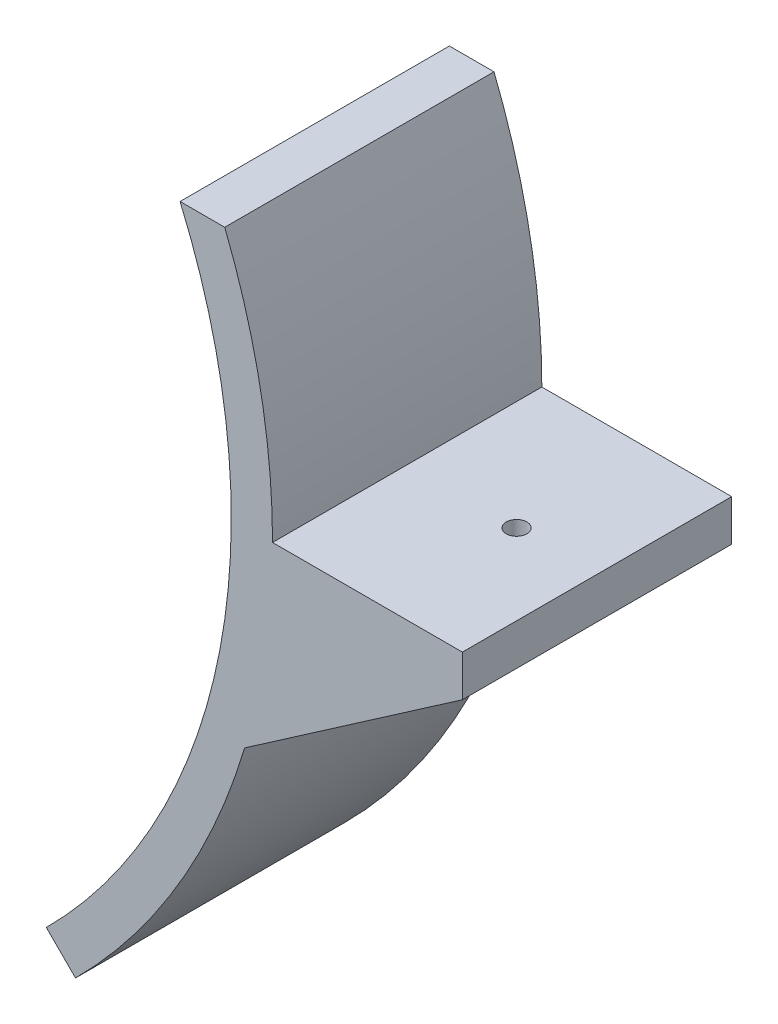
ISO-10303-21;
HEADER;
FILE_DESCRIPTION(('STEP AP214'),'2;1');
FILE_NAME('part.step','',(''),(''),'','','');
FILE_SCHEMA(('AUTOMOTIVE_DESIGN { 1 0 10303 214 1 1 1 1 }'));
ENDSEC;
DATA;
#1=APPLICATION_CONTEXT('core data for automotive mechanical design processes');
#2=APPLICATION_PROTOCOL_DEFINITION('international standard','automotive_design',2000,#1);
#3=PRODUCT_CONTEXT('',#1,'mechanical');
#4=PRODUCT('Part','Part','',(#3));
#5=PRODUCT_RELATED_PRODUCT_CATEGORY('part','',(#4));
#6=PRODUCT_DEFINITION_FORMATION('','',#4);
#7=PRODUCT_DEFINITION_CONTEXT('part definition',#1,'design');
#8=PRODUCT_DEFINITION('design','',#6,#7);
#9=PRODUCT_DEFINITION_SHAPE('','',#8);
#10=(LENGTH_UNIT() NAMED_UNIT(*) SI_UNIT(.MILLI.,.METRE.));
#11=(NAMED_UNIT(*) PLANE_ANGLE_UNIT() SI_UNIT($,.RADIAN.));
#12=(NAMED_UNIT(*) SI_UNIT($,.STERADIAN.) SOLID_ANGLE_UNIT());
#13=UNCERTAINTY_MEASURE_WITH_UNIT(LENGTH_MEASURE(1.E-05),#10,'distance_accuracy_value','');
#14=(GEOMETRIC_REPRESENTATION_CONTEXT(3) GLOBAL_UNCERTAINTY_ASSIGNED_CONTEXT((#13)) GLOBAL_UNIT_ASSIGNED_CONTEXT((#10,
#11,#12)) REPRESENTATION_CONTEXT('',''));
#15=CARTESIAN_POINT('',(0.,0.,0.));
#16=DIRECTION('',(0.,0.,1.));
#17=DIRECTION('',(1.,0.,0.));
#18=AXIS2_PLACEMENT_3D('',#15,#16,#17);
#19=CARTESIAN_POINT('',(0.,0.,65.25));
#20=DIRECTION('',(0.,1.,0.));
#21=DIRECTION('',(0.,0.,1.));
#22=AXIS2_PLACEMENT_3D('',#19,#20,#21);
#23=PLANE('',#22);
#24=CARTESIAN_POINT('',(189.5,0.,32.625));
#25=DIRECTION('',(0.,1.,0.));
#26=DIRECTION('',(0.,0.,1.));
#27=AXIS2_PLACEMENT_3D('',#24,#25,#26);
#28=CIRCLE('',#27,2.5);
#29=CARTESIAN_POINT('',(189.5,0.,35.125));
#30=VERTEX_POINT('',#29);
#31=EDGE_CURVE('E193',#30,#30,#28,.T.);
#32=ORIENTED_EDGE('',*,*,#31,.F.);
#33=EDGE_LOOP('',(#32));
#34=FACE_BOUND('',#33,.T.);
#35=DIRECTION('',(1.,0.,0.));
#36=VECTOR('',#35,1.);
#37=CARTESIAN_POINT('',(0.,0.,0.));
#38=LINE('',#37,#36);
#39=CARTESIAN_POINT('',(163.,0.,0.));
#40=VERTEX_POINT('',#39);
#41=CARTESIAN_POINT('',(209.,0.,0.));
#42=VERTEX_POINT('',#41);
#43=EDGE_CURVE('E146',#40,#42,#38,.T.);
#44=ORIENTED_EDGE('',*,*,#43,.F.);
#45=DIRECTION('',(0.,0.,-1.));
#46=VECTOR('',#45,1.);
#47=CARTESIAN_POINT('',(163.,0.,65.25));
#48=LINE('',#47,#46);
#49=CARTESIAN_POINT('',(163.,0.,65.25));
#50=VERTEX_POINT('',#49);
#51=EDGE_CURVE('E94',#50,#40,#48,.T.);
#52=ORIENTED_EDGE('',*,*,#51,.F.);
#53=DIRECTION('',(1.,0.,0.));
#54=VECTOR('',#53,1.);
#55=CARTESIAN_POINT('',(0.,0.,65.25));
#56=LINE('',#55,#54);
#57=CARTESIAN_POINT('',(209.,0.,65.25));
#58=VERTEX_POINT('',#57);
#59=EDGE_CURVE('E165',#50,#58,#56,.T.);
#60=ORIENTED_EDGE('',*,*,#59,.T.);
#61=DIRECTION('',(0.,0.,-1.));
#62=VECTOR('',#61,1.);
#63=CARTESIAN_POINT('',(209.,0.,65.25));
#64=LINE('',#63,#62);
#65=EDGE_CURVE('E58',#58,#42,#64,.T.);
#66=ORIENTED_EDGE('',*,*,#65,.T.);
#67=EDGE_LOOP('',(#44,#52,#60,#66));
#68=FACE_BOUND('',#67,.T.);
#69=ADVANCED_FACE('F35',(#34,#68),#23,.T.);
#70=CARTESIAN_POINT('',(0.,0.,65.25));
#71=DIRECTION('',(0.,0.,-1.));
#72=DIRECTION('',(-1.,0.,0.));
#73=AXIS2_PLACEMENT_3D('',#70,#71,#72);
#74=CYLINDRICAL_SURFACE('',#73,163.);
#75=CARTESIAN_POINT('',(0.,0.,0.));
#76=DIRECTION('',(0.,0.,1.));
#77=DIRECTION('',(1.,0.,0.));
#78=AXIS2_PLACEMENT_3D('',#75,#76,#77);
#79=CIRCLE('',#78,163.);
#80=CARTESIAN_POINT('',(151.416299169762,60.349849591637,0.));
#81=VERTEX_POINT('',#80);
#82=EDGE_CURVE('E148',#40,#81,#79,.T.);
#83=ORIENTED_EDGE('',*,*,#82,.T.);
#84=DIRECTION('',(0.,0.,-1.));
#85=VECTOR('',#84,1.);
#86=CARTESIAN_POINT('',(151.416299169762,60.349849591637,65.25));
#87=LINE('',#86,#85);
#88=CARTESIAN_POINT('',(151.416299169762,60.349849591637,65.25));
#89=VERTEX_POINT('',#88);
#90=EDGE_CURVE('E174',#89,#81,#87,.T.);
#91=ORIENTED_EDGE('',*,*,#90,.F.);
#92=CARTESIAN_POINT('',(0.,0.,65.25));
#93=DIRECTION('',(0.,0.,1.));
#94=DIRECTION('',(1.,0.,0.));
#95=AXIS2_PLACEMENT_3D('',#92,#93,#94);
#96=CIRCLE('',#95,163.);
#97=EDGE_CURVE('E208',#50,#89,#96,.T.);
#98=ORIENTED_EDGE('',*,*,#97,.F.);
#99=ORIENTED_EDGE('',*,*,#51,.T.);
#100=EDGE_LOOP('',(#83,#91,#98,#99));
#101=FACE_BOUND('',#100,.T.);
#102=ADVANCED_FACE('F238',(#101),#74,.T.);
#103=CARTESIAN_POINT('',(0.,60.349849591637,65.25));
#104=DIRECTION('',(0.,-1.,0.));
#105=DIRECTION('',(0.,0.,-1.));
#106=AXIS2_PLACEMENT_3D('',#103,#104,#105);
#107=PLANE('',#106);
#108=DIRECTION('',(-1.,0.,0.));
#109=VECTOR('',#108,1.);
#110=CARTESIAN_POINT('',(0.,60.349849591637,0.));
#111=LINE('',#110,#109);
#112=CARTESIAN_POINT('',(140.594792415177,60.349849591637,0.));
#113=VERTEX_POINT('',#112);
#114=EDGE_CURVE('E151',#81,#113,#111,.T.);
#115=ORIENTED_EDGE('',*,*,#114,.T.);
#116=DIRECTION('',(0.,0.,-1.));
#117=VECTOR('',#116,1.);
#118=CARTESIAN_POINT('',(140.594792415177,60.349849591637,65.25));
#119=LINE('',#118,#117);
#120=CARTESIAN_POINT('',(140.594792415177,60.349849591637,65.25));
#121=VERTEX_POINT('',#120);
#122=EDGE_CURVE('E172',#121,#113,#119,.T.);
#123=ORIENTED_EDGE('',*,*,#122,.F.);
#124=DIRECTION('',(-1.,0.,0.));
#125=VECTOR('',#124,1.);
#126=CARTESIAN_POINT('',(0.,60.349849591637,65.25));
#127=LINE('',#126,#125);
#128=EDGE_CURVE('E210',#89,#121,#127,.T.);
#129=ORIENTED_EDGE('',*,*,#128,.F.);
#130=ORIENTED_EDGE('',*,*,#90,.T.);
#131=EDGE_LOOP('',(#115,#123,#129,#130));
#132=FACE_BOUND('',#131,.T.);
#133=ADVANCED_FACE('F221',(#132),#107,.F.);
#134=CARTESIAN_POINT('',(0.,0.,65.25));
#135=DIRECTION('',(0.,0.,-1.));
#136=DIRECTION('',(-1.,0.,0.));
#137=AXIS2_PLACEMENT_3D('',#134,#135,#136);
#138=CYLINDRICAL_SURFACE('',#137,153.);
#139=CARTESIAN_POINT('',(0.,0.,0.));
#140=DIRECTION('',(0.,0.,1.));
#141=DIRECTION('',(1.,0.,0.));
#142=AXIS2_PLACEMENT_3D('',#139,#140,#141);
#143=CIRCLE('',#142,153.);
#144=CARTESIAN_POINT('',(108.187337521542,-108.187337521542,0.));
#145=VERTEX_POINT('',#144);
#146=EDGE_CURVE('E154',#145,#113,#143,.T.);
#147=ORIENTED_EDGE('',*,*,#146,.F.);
#148=DIRECTION('',(0.,0.,-1.));
#149=VECTOR('',#148,1.);
#150=CARTESIAN_POINT('',(108.187337521542,-108.187337521542,65.25));
#151=LINE('',#150,#149);
#152=CARTESIAN_POINT('',(108.187337521542,-108.187337521542,65.25));
#153=VERTEX_POINT('',#152);
#154=EDGE_CURVE('E170',#153,#145,#151,.T.);
#155=ORIENTED_EDGE('',*,*,#154,.F.);
#156=CARTESIAN_POINT('',(0.,0.,65.25));
#157=DIRECTION('',(0.,0.,1.));
#158=DIRECTION('',(1.,0.,0.));
#159=AXIS2_PLACEMENT_3D('',#156,#157,#158);
#160=CIRCLE('',#159,153.);
#161=EDGE_CURVE('E212',#153,#121,#160,.T.);
#162=ORIENTED_EDGE('',*,*,#161,.T.);
#163=ORIENTED_EDGE('',*,*,#122,.T.);
#164=EDGE_LOOP('',(#147,#155,#162,#163));
#165=FACE_BOUND('',#164,.T.);
#166=ADVANCED_FACE('F216',(#165),#138,.F.);
#167=CARTESIAN_POINT('',(0.,0.,65.25));
#168=DIRECTION('',(0.707106781186549,0.707106781186546,0.));
#169=DIRECTION('',(-0.707106781186546,0.707106781186549,0.));
#170=AXIS2_PLACEMENT_3D('',#167,#168,#169);
#171=PLANE('',#170);
#172=DIRECTION('',(0.707106781186546,-0.707106781186549,0.));
#173=VECTOR('',#172,1.);
#174=CARTESIAN_POINT('',(0.,0.,0.));
#175=LINE('',#174,#173);
#176=CARTESIAN_POINT('',(115.258405333407,-115.258405333407,0.));
#177=VERTEX_POINT('',#176);
#178=EDGE_CURVE('E157',#145,#177,#175,.T.);
#179=ORIENTED_EDGE('',*,*,#178,.T.);
#180=DIRECTION('',(0.,0.,-1.));
#181=VECTOR('',#180,1.);
#182=CARTESIAN_POINT('',(115.258405333407,-115.258405333407,65.25));
#183=LINE('',#182,#181);
#184=CARTESIAN_POINT('',(115.258405333407,-115.258405333407,65.25));
#185=VERTEX_POINT('',#184);
#186=EDGE_CURVE('E135',#185,#177,#183,.T.);
#187=ORIENTED_EDGE('',*,*,#186,.F.);
#188=DIRECTION('',(0.707106781186546,-0.707106781186549,0.));
#189=VECTOR('',#188,1.);
#190=CARTESIAN_POINT('',(0.,0.,65.25));
#191=LINE('',#190,#189);
#192=EDGE_CURVE('E122',#153,#185,#191,.T.);
#193=ORIENTED_EDGE('',*,*,#192,.F.);
#194=ORIENTED_EDGE('',*,*,#154,.T.);
#195=EDGE_LOOP('',(#179,#187,#193,#194));
#196=FACE_BOUND('',#195,.T.);
#197=ADVANCED_FACE('F228',(#196),#171,.F.);
#198=CARTESIAN_POINT('',(0.,0.,65.25));
#199=DIRECTION('',(0.,0.,-1.));
#200=DIRECTION('',(-1.,0.,0.));
#201=AXIS2_PLACEMENT_3D('',#198,#199,#200);
#202=CYLINDRICAL_SURFACE('',#201,163.);
#203=CARTESIAN_POINT('',(0.,0.,0.));
#204=DIRECTION('',(0.,0.,1.));
#205=DIRECTION('',(1.,0.,0.));
#206=AXIS2_PLACEMENT_3D('',#203,#204,#205);
#207=CIRCLE('',#206,163.);
#208=CARTESIAN_POINT('',(156.226502146196,-46.5003228716154,0.));
#209=VERTEX_POINT('',#208);
#210=EDGE_CURVE('E131',#177,#209,#207,.T.);
#211=ORIENTED_EDGE('',*,*,#210,.T.);
#212=DIRECTION('',(0.,0.,-1.));
#213=VECTOR('',#212,1.);
#214=CARTESIAN_POINT('',(156.226502146196,-46.5003228716154,65.25));
#215=LINE('',#214,#213);
#216=CARTESIAN_POINT('',(156.226502146196,-46.5003228716154,65.25));
#217=VERTEX_POINT('',#216);
#218=EDGE_CURVE('E128',#217,#209,#215,.T.);
#219=ORIENTED_EDGE('',*,*,#218,.F.);
#220=CARTESIAN_POINT('',(0.,0.,65.25));
#221=DIRECTION('',(0.,0.,1.));
#222=DIRECTION('',(1.,0.,0.));
#223=AXIS2_PLACEMENT_3D('',#220,#221,#222);
#224=CIRCLE('',#223,163.);
#225=EDGE_CURVE('E113',#185,#217,#224,.T.);
#226=ORIENTED_EDGE('',*,*,#225,.F.);
#227=ORIENTED_EDGE('',*,*,#186,.T.);
#228=EDGE_LOOP('',(#211,#219,#226,#227));
#229=FACE_BOUND('',#228,.T.);
#230=ADVANCED_FACE('F129',(#229),#202,.T.);
#231=CARTESIAN_POINT('',(72.3062545641242,-104.543019618706,65.25));
#232=DIRECTION('',(0.568839341288312,-0.822448663323541,0.));
#233=DIRECTION('',(0.822448663323541,0.568839341288312,0.));
#234=AXIS2_PLACEMENT_3D('',#231,#232,#233);
#235=PLANE('',#234);
#236=DIRECTION('',(-0.822448663323541,-0.568839341288312,0.));
#237=VECTOR('',#236,1.);
#238=CARTESIAN_POINT('',(72.3062545641242,-104.543019618706,55.25));
#239=LINE('',#238,#237);
#240=CARTESIAN_POINT('',(209.,-10.,55.25));
#241=VERTEX_POINT('',#240);
#242=CARTESIAN_POINT('',(164.,-41.1238518578565,55.25));
#243=VERTEX_POINT('',#242);
#244=EDGE_CURVE('E11',#241,#243,#239,.T.);
#245=ORIENTED_EDGE('',*,*,#244,.F.);
#246=DIRECTION('',(0.,0.,-1.));
#247=VECTOR('',#246,1.);
#248=CARTESIAN_POINT('',(209.,-10.,65.25));
#249=LINE('',#248,#247);
#250=CARTESIAN_POINT('',(209.,-10.,65.25));
#251=VERTEX_POINT('',#250);
#252=EDGE_CURVE('E136',#251,#241,#249,.T.);
#253=ORIENTED_EDGE('',*,*,#252,.F.);
#254=DIRECTION('',(-0.822448663323541,-0.568839341288312,0.));
#255=VECTOR('',#254,1.);
#256=CARTESIAN_POINT('',(72.3062545641242,-104.543019618706,65.25));
#257=LINE('',#256,#255);
#258=EDGE_CURVE('E119',#251,#217,#257,.T.);
#259=ORIENTED_EDGE('',*,*,#258,.T.);
#260=ORIENTED_EDGE('',*,*,#218,.T.);
#261=DIRECTION('',(-0.822448663323541,-0.568839341288312,0.));
#262=VECTOR('',#261,1.);
#263=CARTESIAN_POINT('',(72.3062545641242,-104.543019618706,0.));
#264=LINE('',#263,#262);
#265=CARTESIAN_POINT('',(209.,-10.,0.));
#266=VERTEX_POINT('',#265);
#267=EDGE_CURVE('E160',#266,#209,#264,.T.);
#268=ORIENTED_EDGE('',*,*,#267,.F.);
#269=CARTESIAN_POINT('',(209.,-10.,10.));
#270=VERTEX_POINT('',#269);
#271=EDGE_CURVE('E167',#270,#266,#249,.T.);
#272=ORIENTED_EDGE('',*,*,#271,.F.);
#273=DIRECTION('',(0.822448663323541,0.568839341288312,0.));
#274=VECTOR('',#273,1.);
#275=CARTESIAN_POINT('',(72.3062545641242,-104.543019618706,10.));
#276=LINE('',#275,#274);
#277=CARTESIAN_POINT('',(164.,-41.1238518578565,10.));
#278=VERTEX_POINT('',#277);
#279=EDGE_CURVE('E42',#278,#270,#276,.T.);
#280=ORIENTED_EDGE('',*,*,#279,.F.);
#281=DIRECTION('',(0.,0.,1.));
#282=VECTOR('',#281,1.);
#283=CARTESIAN_POINT('',(164.,-41.1238518578565,65.25));
#284=LINE('',#283,#282);
#285=EDGE_CURVE('E178',#278,#243,#284,.T.);
#286=ORIENTED_EDGE('',*,*,#285,.T.);
#287=EDGE_LOOP('',(#245,#253,#259,#260,#268,#272,#280,#286));
#288=FACE_BOUND('',#287,.T.);
#289=ADVANCED_FACE('F139',(#288),#235,.T.);
#290=CARTESIAN_POINT('',(209.,0.,65.25));
#291=DIRECTION('',(1.,0.,0.));
#292=DIRECTION('',(0.,0.,-1.));
#293=AXIS2_PLACEMENT_3D('',#290,#291,#292);
#294=PLANE('',#293);
#295=DIRECTION('',(0.,-1.,0.));
#296=VECTOR('',#295,1.);
#297=CARTESIAN_POINT('',(209.,0.,0.));
#298=LINE('',#297,#296);
#299=EDGE_CURVE('E162',#42,#266,#298,.T.);
#300=ORIENTED_EDGE('',*,*,#299,.F.);
#301=ORIENTED_EDGE('',*,*,#65,.F.);
#302=DIRECTION('',(0.,-1.,0.));
#303=VECTOR('',#302,1.);
#304=CARTESIAN_POINT('',(209.,0.,65.25));
#305=LINE('',#304,#303);
#306=EDGE_CURVE('E141',#58,#251,#305,.T.);
#307=ORIENTED_EDGE('',*,*,#306,.T.);
#308=ORIENTED_EDGE('',*,*,#252,.T.);
#309=DIRECTION('',(0.,0.,-1.));
#310=VECTOR('',#309,1.);
#311=CARTESIAN_POINT('',(209.,-10.,0.));
#312=LINE('',#311,#310);
#313=EDGE_CURVE('E189',#241,#270,#312,.T.);
#314=ORIENTED_EDGE('',*,*,#313,.T.);
#315=ORIENTED_EDGE('',*,*,#271,.T.);
#316=EDGE_LOOP('',(#300,#301,#307,#308,#314,#315));
#317=FACE_BOUND('',#316,.T.);
#318=ADVANCED_FACE('F190',(#317),#294,.T.);
#319=CARTESIAN_POINT('',(0.,0.,65.25));
#320=DIRECTION('',(0.,0.,1.));
#321=DIRECTION('',(1.,0.,0.));
#322=AXIS2_PLACEMENT_3D('',#319,#320,#321);
#323=PLANE('',#322);
#324=ORIENTED_EDGE('',*,*,#59,.F.);
#325=ORIENTED_EDGE('',*,*,#97,.T.);
#326=ORIENTED_EDGE('',*,*,#128,.T.);
#327=ORIENTED_EDGE('',*,*,#161,.F.);
#328=ORIENTED_EDGE('',*,*,#192,.T.);
#329=ORIENTED_EDGE('',*,*,#225,.T.);
#330=ORIENTED_EDGE('',*,*,#258,.F.);
#331=ORIENTED_EDGE('',*,*,#306,.F.);
#332=EDGE_LOOP('',(#324,#325,#326,#327,#328,#329,#330,#331));
#333=FACE_BOUND('',#332,.T.);
#334=ADVANCED_FACE('F116',(#333),#323,.T.);
#335=CARTESIAN_POINT('',(0.,0.,0.));
#336=DIRECTION('',(0.,0.,1.));
#337=DIRECTION('',(1.,0.,0.));
#338=AXIS2_PLACEMENT_3D('',#335,#336,#337);
#339=PLANE('',#338);
#340=ORIENTED_EDGE('',*,*,#43,.T.);
#341=ORIENTED_EDGE('',*,*,#299,.T.);
#342=ORIENTED_EDGE('',*,*,#267,.T.);
#343=ORIENTED_EDGE('',*,*,#210,.F.);
#344=ORIENTED_EDGE('',*,*,#178,.F.);
#345=ORIENTED_EDGE('',*,*,#146,.T.);
#346=ORIENTED_EDGE('',*,*,#114,.F.);
#347=ORIENTED_EDGE('',*,*,#82,.F.);
#348=EDGE_LOOP('',(#340,#341,#342,#343,#344,#345,#346,#347));
#349=FACE_BOUND('',#348,.T.);
#350=ADVANCED_FACE('F226',(#349),#339,.F.);
#351=CARTESIAN_POINT('',(164.,0.,55.25));
#352=DIRECTION('',(0.,0.,1.));
#353=DIRECTION('',(1.,0.,0.));
#354=AXIS2_PLACEMENT_3D('',#351,#352,#353);
#355=PLANE('',#354);
#356=ORIENTED_EDGE('',*,*,#244,.T.);
#357=DIRECTION('',(0.,-1.,0.));
#358=VECTOR('',#357,1.);
#359=CARTESIAN_POINT('',(164.,0.,55.25));
#360=LINE('',#359,#358);
#361=CARTESIAN_POINT('',(164.,-10.,55.25));
#362=VERTEX_POINT('',#361);
#363=EDGE_CURVE('E202',#362,#243,#360,.T.);
#364=ORIENTED_EDGE('',*,*,#363,.F.);
#365=DIRECTION('',(1.,0.,0.));
#366=VECTOR('',#365,1.);
#367=CARTESIAN_POINT('',(164.,-10.,55.25));
#368=LINE('',#367,#366);
#369=EDGE_CURVE('E149',#362,#241,#368,.T.);
#370=ORIENTED_EDGE('',*,*,#369,.T.);
#371=EDGE_LOOP('',(#356,#364,#370));
#372=FACE_BOUND('',#371,.T.);
#373=ADVANCED_FACE('F264',(#372),#355,.F.);
#374=CARTESIAN_POINT('',(164.,-10.,0.));
#375=DIRECTION('',(0.,-1.,0.));
#376=DIRECTION('',(0.,0.,-1.));
#377=AXIS2_PLACEMENT_3D('',#374,#375,#376);
#378=PLANE('',#377);
#379=CARTESIAN_POINT('',(189.5,-10.,32.625));
#380=DIRECTION('',(0.,-1.,0.));
#381=DIRECTION('',(0.,0.,-1.));
#382=AXIS2_PLACEMENT_3D('',#379,#380,#381);
#383=CIRCLE('',#382,2.5);
#384=CARTESIAN_POINT('',(189.5,-10.,30.125));
#385=VERTEX_POINT('',#384);
#386=EDGE_CURVE('E198',#385,#385,#383,.T.);
#387=ORIENTED_EDGE('',*,*,#386,.F.);
#388=EDGE_LOOP('',(#387));
#389=FACE_BOUND('',#388,.T.);
#390=ORIENTED_EDGE('',*,*,#313,.F.);
#391=ORIENTED_EDGE('',*,*,#369,.F.);
#392=DIRECTION('',(0.,0.,-1.));
#393=VECTOR('',#392,1.);
#394=CARTESIAN_POINT('',(164.,-10.,0.));
#395=LINE('',#394,#393);
#396=CARTESIAN_POINT('',(164.,-10.,10.));
#397=VERTEX_POINT('',#396);
#398=EDGE_CURVE('E195',#362,#397,#395,.T.);
#399=ORIENTED_EDGE('',*,*,#398,.T.);
#400=DIRECTION('',(1.,0.,0.));
#401=VECTOR('',#400,1.);
#402=CARTESIAN_POINT('',(164.,-10.,10.));
#403=LINE('',#402,#401);
#404=EDGE_CURVE('E49',#397,#270,#403,.T.);
#405=ORIENTED_EDGE('',*,*,#404,.T.);
#406=EDGE_LOOP('',(#390,#391,#399,#405));
#407=FACE_BOUND('',#406,.T.);
#408=ADVANCED_FACE('F265',(#389,#407),#378,.T.);
#409=CARTESIAN_POINT('',(164.,0.,10.));
#410=DIRECTION('',(0.,0.,-1.));
#411=DIRECTION('',(-1.,0.,0.));
#412=AXIS2_PLACEMENT_3D('',#409,#410,#411);
#413=PLANE('',#412);
#414=ORIENTED_EDGE('',*,*,#279,.T.);
#415=ORIENTED_EDGE('',*,*,#404,.F.);
#416=DIRECTION('',(0.,1.,0.));
#417=VECTOR('',#416,1.);
#418=CARTESIAN_POINT('',(164.,0.,10.));
#419=LINE('',#418,#417);
#420=EDGE_CURVE('E187',#278,#397,#419,.T.);
#421=ORIENTED_EDGE('',*,*,#420,.F.);
#422=EDGE_LOOP('',(#414,#415,#421));
#423=FACE_BOUND('',#422,.T.);
#424=ADVANCED_FACE('F184',(#423),#413,.F.);
#425=CARTESIAN_POINT('',(164.,0.,0.));
#426=DIRECTION('',(1.,0.,0.));
#427=DIRECTION('',(0.,0.,-1.));
#428=AXIS2_PLACEMENT_3D('',#425,#426,#427);
#429=PLANE('',#428);
#430=ORIENTED_EDGE('',*,*,#420,.T.);
#431=ORIENTED_EDGE('',*,*,#398,.F.);
#432=ORIENTED_EDGE('',*,*,#363,.T.);
#433=ORIENTED_EDGE('',*,*,#285,.F.);
#434=EDGE_LOOP('',(#430,#431,#432,#433));
#435=FACE_BOUND('',#434,.T.);
#436=ADVANCED_FACE('F249',(#435),#429,.T.);
#437=CARTESIAN_POINT('',(189.5,35.,32.625));
#438=DIRECTION('',(0.,-1.,0.));
#439=DIRECTION('',(0.,0.,-1.));
#440=AXIS2_PLACEMENT_3D('',#437,#438,#439);
#441=CYLINDRICAL_SURFACE('',#440,2.5);
#442=ORIENTED_EDGE('',*,*,#31,.T.);
#443=EDGE_LOOP('',(#442));
#444=FACE_BOUND('',#443,.T.);
#445=ORIENTED_EDGE('',*,*,#386,.T.);
#446=EDGE_LOOP('',(#445));
#447=FACE_BOUND('',#446,.T.);
#448=ADVANCED_FACE('F246',(#444,#447),#441,.F.);
#449=CLOSED_SHELL('',(#69,#102,#133,#166,#197,#230,#289,#318,#334,#350,#373,#408,#424,#436,#448));
#450=MANIFOLD_SOLID_BREP('B2',#449);
#451=ADVANCED_BREP_SHAPE_REPRESENTATION('',(#18,#450),#14);
#452=SHAPE_DEFINITION_REPRESENTATION(#9,#451);
ENDSEC;
END-ISO-10303-21;
